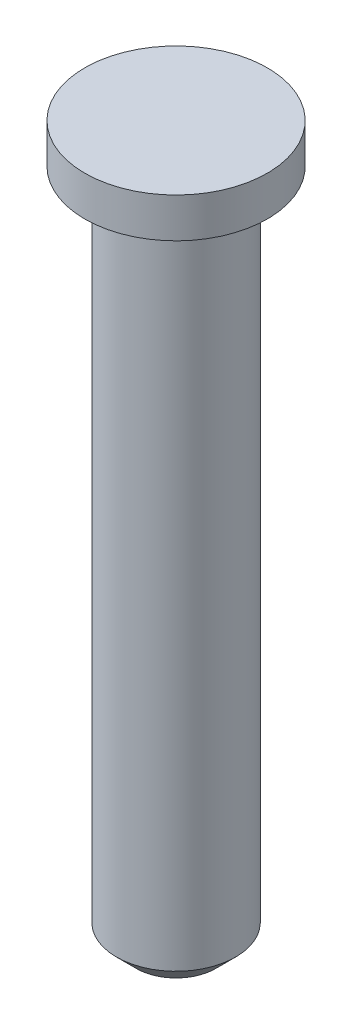
ISO-10303-21;
HEADER;
FILE_DESCRIPTION(('STEP AP214'),'2;1');
FILE_NAME('part.step','',(''),(''),'','','');
FILE_SCHEMA(('AUTOMOTIVE_DESIGN { 1 0 10303 214 1 1 1 1 }'));
ENDSEC;
DATA;
#1=APPLICATION_CONTEXT('core data for automotive mechanical design processes');
#2=APPLICATION_PROTOCOL_DEFINITION('international standard','automotive_design',2000,#1);
#3=PRODUCT_CONTEXT('',#1,'mechanical');
#4=PRODUCT('Part','Part','',(#3));
#5=PRODUCT_RELATED_PRODUCT_CATEGORY('part','',(#4));
#6=PRODUCT_DEFINITION_FORMATION('','',#4);
#7=PRODUCT_DEFINITION_CONTEXT('part definition',#1,'design');
#8=PRODUCT_DEFINITION('design','',#6,#7);
#9=PRODUCT_DEFINITION_SHAPE('','',#8);
#10=(LENGTH_UNIT() NAMED_UNIT(*) SI_UNIT(.MILLI.,.METRE.));
#11=(NAMED_UNIT(*) PLANE_ANGLE_UNIT() SI_UNIT($,.RADIAN.));
#12=(NAMED_UNIT(*) SI_UNIT($,.STERADIAN.) SOLID_ANGLE_UNIT());
#13=UNCERTAINTY_MEASURE_WITH_UNIT(LENGTH_MEASURE(1.E-05),#10,'distance_accuracy_value','');
#14=(GEOMETRIC_REPRESENTATION_CONTEXT(3) GLOBAL_UNCERTAINTY_ASSIGNED_CONTEXT((#13)) GLOBAL_UNIT_ASSIGNED_CONTEXT((#10,
#11,#12)) REPRESENTATION_CONTEXT('',''));
#15=CARTESIAN_POINT('',(0.,0.,0.));
#16=DIRECTION('',(0.,0.,1.));
#17=DIRECTION('',(1.,0.,0.));
#18=AXIS2_PLACEMENT_3D('',#15,#16,#17);
#19=CARTESIAN_POINT('',(0.,0.,0.));
#20=DIRECTION('',(0.,-1.,0.));
#21=DIRECTION('',(0.,0.,-1.));
#22=AXIS2_PLACEMENT_3D('',#19,#20,#21);
#23=PLANE('',#22);
#24=CARTESIAN_POINT('',(0.,0.,0.));
#25=DIRECTION('',(0.,1.,0.));
#26=DIRECTION('',(0.,0.,1.));
#27=AXIS2_PLACEMENT_3D('',#24,#25,#26);
#28=CIRCLE('',#27,2.3);
#29=CARTESIAN_POINT('',(0.,0.,2.3));
#30=VERTEX_POINT('',#29);
#31=EDGE_CURVE('E42',#30,#30,#28,.T.);
#32=ORIENTED_EDGE('',*,*,#31,.T.);
#33=EDGE_LOOP('',(#32));
#34=FACE_BOUND('',#33,.T.);
#35=ADVANCED_FACE('F31',(#34),#23,.F.);
#36=CARTESIAN_POINT('',(0.,0.,0.));
#37=DIRECTION('',(0.,1.,0.));
#38=DIRECTION('',(0.,0.,1.));
#39=AXIS2_PLACEMENT_3D('',#36,#37,#38);
#40=CYLINDRICAL_SURFACE('',#39,2.3);
#41=ORIENTED_EDGE('',*,*,#31,.F.);
#42=EDGE_LOOP('',(#41));
#43=FACE_BOUND('',#42,.T.);
#44=CARTESIAN_POINT('',(0.,-1.,0.));
#45=DIRECTION('',(0.,1.,0.));
#46=DIRECTION('',(0.,0.,1.));
#47=AXIS2_PLACEMENT_3D('',#44,#45,#46);
#48=CIRCLE('',#47,2.3);
#49=CARTESIAN_POINT('',(0.,-1.,2.3));
#50=VERTEX_POINT('',#49);
#51=EDGE_CURVE('E46',#50,#50,#48,.T.);
#52=ORIENTED_EDGE('',*,*,#51,.T.);
#53=EDGE_LOOP('',(#52));
#54=FACE_BOUND('',#53,.T.);
#55=ADVANCED_FACE('F66',(#43,#54),#40,.T.);
#56=CARTESIAN_POINT('',(2.3,-1.,0.));
#57=DIRECTION('',(0.,1.,0.));
#58=DIRECTION('',(0.,0.,1.));
#59=AXIS2_PLACEMENT_3D('',#56,#57,#58);
#60=PLANE('',#59);
#61=ORIENTED_EDGE('',*,*,#51,.F.);
#62=EDGE_LOOP('',(#61));
#63=FACE_BOUND('',#62,.T.);
#64=CARTESIAN_POINT('',(0.,-1.,0.));
#65=DIRECTION('',(0.,1.,0.));
#66=DIRECTION('',(0.,0.,1.));
#67=AXIS2_PLACEMENT_3D('',#64,#65,#66);
#68=CIRCLE('',#67,1.5);
#69=CARTESIAN_POINT('',(0.,-1.,1.5));
#70=VERTEX_POINT('',#69);
#71=EDGE_CURVE('E51',#70,#70,#68,.T.);
#72=ORIENTED_EDGE('',*,*,#71,.T.);
#73=EDGE_LOOP('',(#72));
#74=FACE_BOUND('',#73,.T.);
#75=ADVANCED_FACE('F55',(#63,#74),#60,.F.);
#76=CARTESIAN_POINT('',(0.,0.,0.));
#77=DIRECTION('',(0.,1.,0.));
#78=DIRECTION('',(0.,0.,1.));
#79=AXIS2_PLACEMENT_3D('',#76,#77,#78);
#80=CYLINDRICAL_SURFACE('',#79,1.5);
#81=CARTESIAN_POINT('',(0.,-17.5,0.));
#82=DIRECTION('',(0.,1.,0.));
#83=DIRECTION('',(0.,0.,1.));
#84=AXIS2_PLACEMENT_3D('',#81,#82,#83);
#85=CIRCLE('',#84,1.5);
#86=CARTESIAN_POINT('',(0.,-17.5,1.5));
#87=VERTEX_POINT('',#86);
#88=EDGE_CURVE('E38',#87,#87,#85,.T.);
#89=ORIENTED_EDGE('',*,*,#88,.T.);
#90=EDGE_LOOP('',(#89));
#91=FACE_BOUND('',#90,.T.);
#92=ORIENTED_EDGE('',*,*,#71,.F.);
#93=EDGE_LOOP('',(#92));
#94=FACE_BOUND('',#93,.T.);
#95=ADVANCED_FACE('F57',(#91,#94),#80,.T.);
#96=CARTESIAN_POINT('',(1.5,-18.,0.));
#97=DIRECTION('',(0.,1.,0.));
#98=DIRECTION('',(0.,0.,1.));
#99=AXIS2_PLACEMENT_3D('',#96,#97,#98);
#100=PLANE('',#99);
#101=CARTESIAN_POINT('',(0.,-18.,0.));
#102=DIRECTION('',(0.,1.,0.));
#103=DIRECTION('',(0.,0.,1.));
#104=AXIS2_PLACEMENT_3D('',#101,#102,#103);
#105=CIRCLE('',#104,0.999999999999999);
#106=CARTESIAN_POINT('',(0.,-18.,0.999999999999999));
#107=VERTEX_POINT('',#106);
#108=EDGE_CURVE('E10',#107,#107,#105,.F.);
#109=ORIENTED_EDGE('',*,*,#108,.T.);
#110=EDGE_LOOP('',(#109));
#111=FACE_BOUND('',#110,.T.);
#112=ADVANCED_FACE('F59',(#111),#100,.F.);
#113=CARTESIAN_POINT('',(0.,-17.5,0.));
#114=DIRECTION('',(0.,1.,0.));
#115=DIRECTION('',(0.,0.,1.));
#116=AXIS2_PLACEMENT_3D('',#113,#114,#115);
#117=CONICAL_SURFACE('',#116,1.5,0.78539816339745);
#118=ORIENTED_EDGE('',*,*,#108,.F.);
#119=EDGE_LOOP('',(#118));
#120=FACE_BOUND('',#119,.T.);
#121=ORIENTED_EDGE('',*,*,#88,.F.);
#122=EDGE_LOOP('',(#121));
#123=FACE_BOUND('',#122,.T.);
#124=ADVANCED_FACE('F33',(#120,#123),#117,.T.);
#125=CLOSED_SHELL('',(#35,#55,#75,#95,#112,#124));
#126=MANIFOLD_SOLID_BREP('B2',#125);
#127=ADVANCED_BREP_SHAPE_REPRESENTATION('',(#18,#126),#14);
#128=SHAPE_DEFINITION_REPRESENTATION(#9,#127);
ENDSEC;
END-ISO-10303-21;
